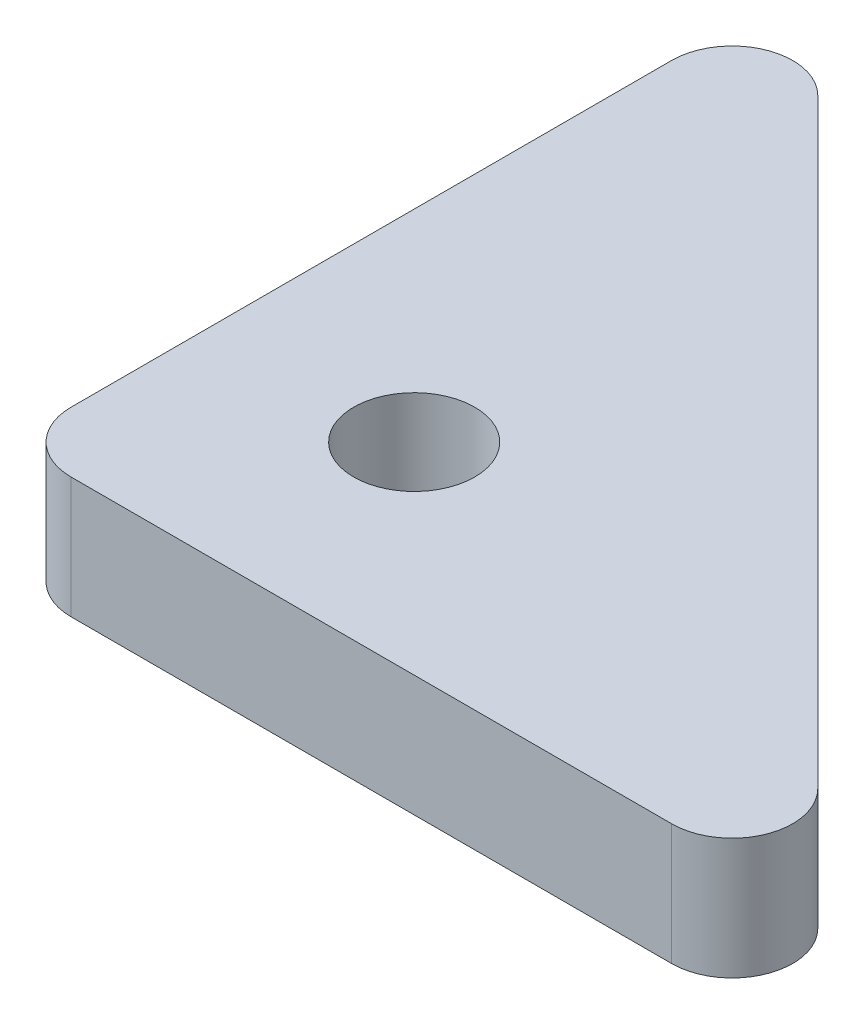
ISO-10303-21;
HEADER;
FILE_DESCRIPTION(('STEP AP214'),'2;1');
FILE_NAME('part.step','',(''),(''),'','','');
FILE_SCHEMA(('AUTOMOTIVE_DESIGN { 1 0 10303 214 1 1 1 1 }'));
ENDSEC;
DATA;
#1=APPLICATION_CONTEXT('core data for automotive mechanical design processes');
#2=APPLICATION_PROTOCOL_DEFINITION('international standard','automotive_design',2000,#1);
#3=PRODUCT_CONTEXT('',#1,'mechanical');
#4=PRODUCT('Part','Part','',(#3));
#5=PRODUCT_RELATED_PRODUCT_CATEGORY('part','',(#4));
#6=PRODUCT_DEFINITION_FORMATION('','',#4);
#7=PRODUCT_DEFINITION_CONTEXT('part definition',#1,'design');
#8=PRODUCT_DEFINITION('design','',#6,#7);
#9=PRODUCT_DEFINITION_SHAPE('','',#8);
#10=(LENGTH_UNIT() NAMED_UNIT(*) SI_UNIT(.MILLI.,.METRE.));
#11=(NAMED_UNIT(*) PLANE_ANGLE_UNIT() SI_UNIT($,.RADIAN.));
#12=(NAMED_UNIT(*) SI_UNIT($,.STERADIAN.) SOLID_ANGLE_UNIT());
#13=UNCERTAINTY_MEASURE_WITH_UNIT(LENGTH_MEASURE(1.E-05),#10,'distance_accuracy_value','');
#14=(GEOMETRIC_REPRESENTATION_CONTEXT(3) GLOBAL_UNCERTAINTY_ASSIGNED_CONTEXT((#13)) GLOBAL_UNIT_ASSIGNED_CONTEXT((#10,
#11,#12)) REPRESENTATION_CONTEXT('',''));
#15=CARTESIAN_POINT('',(0.,0.,0.));
#16=DIRECTION('',(0.,0.,1.));
#17=DIRECTION('',(1.,0.,0.));
#18=AXIS2_PLACEMENT_3D('',#15,#16,#17);
#19=CARTESIAN_POINT('',(2.99999999999995,0.,-3.00000000000011));
#20=DIRECTION('',(0.,-1.,0.));
#21=DIRECTION('',(1.,0.,0.));
#22=AXIS2_PLACEMENT_3D('',#19,#20,#21);
#23=PLANE('',#22);
#24=CARTESIAN_POINT('',(9.9999999999984,0.,-10.));
#25=DIRECTION('',(0.,-1.,0.));
#26=DIRECTION('',(1.,0.,0.));
#27=AXIS2_PLACEMENT_3D('',#24,#25,#26);
#28=CIRCLE('',#27,3.00000000000007);
#29=CARTESIAN_POINT('',(12.9999999999985,0.,-10.));
#30=VERTEX_POINT('',#29);
#31=EDGE_CURVE('E105',#30,#30,#28,.F.);
#32=ORIENTED_EDGE('',*,*,#31,.T.);
#33=EDGE_LOOP('',(#32));
#34=FACE_BOUND('',#33,.T.);
#35=CARTESIAN_POINT('',(32.7573593128807,0.,-3.00000000000011));
#36=DIRECTION('',(0.,-1.,0.));
#37=DIRECTION('',(1.,0.,0.));
#38=AXIS2_PLACEMENT_3D('',#35,#36,#37);
#39=CIRCLE('',#38,3.00000000000007);
#40=CARTESIAN_POINT('',(32.7573593128806,0.,0.));
#41=VERTEX_POINT('',#40);
#42=CARTESIAN_POINT('',(34.8786796564402,0.,-5.12132034355967));
#43=VERTEX_POINT('',#42);
#44=EDGE_CURVE('E95',#41,#43,#39,.F.);
#45=ORIENTED_EDGE('',*,*,#44,.F.);
#46=DIRECTION('',(-1.,0.,0.));
#47=VECTOR('',#46,1.);
#48=CARTESIAN_POINT('',(3.,0.,0.));
#49=LINE('',#48,#47);
#50=CARTESIAN_POINT('',(2.99999999999992,0.,0.));
#51=VERTEX_POINT('',#50);
#52=EDGE_CURVE('E91',#41,#51,#49,.T.);
#53=ORIENTED_EDGE('',*,*,#52,.T.);
#54=CARTESIAN_POINT('',(2.99999999999984,0.,-3.00000000000011));
#55=DIRECTION('',(0.,-1.,0.));
#56=DIRECTION('',(1.,0.,0.));
#57=AXIS2_PLACEMENT_3D('',#54,#55,#56);
#58=CIRCLE('',#57,3.00000000000007);
#59=CARTESIAN_POINT('',(-2.64285121565067E-12,0.,-3.00000000000011));
#60=VERTEX_POINT('',#59);
#61=EDGE_CURVE('E79',#60,#51,#58,.F.);
#62=ORIENTED_EDGE('',*,*,#61,.F.);
#63=DIRECTION('',(0.,0.,1.));
#64=VECTOR('',#63,1.);
#65=CARTESIAN_POINT('',(-5.05151476204446E-12,0.,-3.00000000000011));
#66=LINE('',#65,#64);
#67=CARTESIAN_POINT('',(-3.36536354339501E-12,0.,-32.7573593128807));
#68=VERTEX_POINT('',#67);
#69=EDGE_CURVE('E77',#60,#68,#66,.F.);
#70=ORIENTED_EDGE('',*,*,#69,.T.);
#71=CARTESIAN_POINT('',(2.99999999999839,0.,-32.7573593128807));
#72=DIRECTION('',(0.,-1.,0.));
#73=DIRECTION('',(1.,0.,0.));
#74=AXIS2_PLACEMENT_3D('',#71,#72,#73);
#75=CIRCLE('',#74,3.00000000000007);
#76=CARTESIAN_POINT('',(5.12132034355809,0.,-34.8786796564404));
#77=VERTEX_POINT('',#76);
#78=EDGE_CURVE('E19',#77,#68,#75,.F.);
#79=ORIENTED_EDGE('',*,*,#78,.F.);
#80=DIRECTION('',(0.707106781186559,0.,0.707106781186536));
#81=VECTOR('',#80,1.);
#82=CARTESIAN_POINT('',(5.12132034355811,0.,-34.8786796564404));
#83=LINE('',#82,#81);
#84=EDGE_CURVE('E94',#77,#43,#83,.T.);
#85=ORIENTED_EDGE('',*,*,#84,.T.);
#86=EDGE_LOOP('',(#45,#53,#62,#70,#79,#85));
#87=FACE_BOUND('',#86,.T.);
#88=ADVANCED_FACE('F16',(#34,#87),#23,.T.);
#89=CARTESIAN_POINT('',(-5.05151476204446E-12,6.00000000000001,-3.00000000000011));
#90=DIRECTION('',(1.,0.,0.));
#91=DIRECTION('',(0.,1.,0.));
#92=AXIS2_PLACEMENT_3D('',#89,#90,#91);
#93=PLANE('',#92);
#94=DIRECTION('',(0.,-1.,0.));
#95=VECTOR('',#94,1.);
#96=CARTESIAN_POINT('',(-2.34187669256869E-13,6.00000000000001,-3.00000000000011));
#97=LINE('',#96,#95);
#98=CARTESIAN_POINT('',(-2.64285121565067E-12,6.00000000000001,-3.00000000000011));
#99=VERTEX_POINT('',#98);
#100=EDGE_CURVE('E108',#99,#60,#97,.T.);
#101=ORIENTED_EDGE('',*,*,#100,.F.);
#102=DIRECTION('',(0.,0.,1.));
#103=VECTOR('',#102,1.);
#104=CARTESIAN_POINT('',(-5.05151476204446E-12,6.00000000000001,-3.00000000000011));
#105=LINE('',#104,#103);
#106=CARTESIAN_POINT('',(-3.36536354339501E-12,6.00000000000001,-32.7573593128807));
#107=VERTEX_POINT('',#106);
#108=EDGE_CURVE('E86',#99,#107,#105,.F.);
#109=ORIENTED_EDGE('',*,*,#108,.T.);
#110=DIRECTION('',(0.,-1.,0.));
#111=VECTOR('',#110,1.);
#112=CARTESIAN_POINT('',(-1.67921232474555E-12,6.00000000000001,-32.7573593128807));
#113=LINE('',#112,#111);
#114=EDGE_CURVE('E72',#68,#107,#113,.F.);
#115=ORIENTED_EDGE('',*,*,#114,.F.);
#116=ORIENTED_EDGE('',*,*,#69,.F.);
#117=EDGE_LOOP('',(#101,#109,#115,#116));
#118=FACE_BOUND('',#117,.T.);
#119=ADVANCED_FACE('F85',(#118),#93,.F.);
#120=CARTESIAN_POINT('',(2.99999999999839,6.00000000000001,-32.7573593128807));
#121=DIRECTION('',(0.,-1.,0.));
#122=DIRECTION('',(1.,0.,0.));
#123=AXIS2_PLACEMENT_3D('',#120,#121,#122);
#124=CYLINDRICAL_SURFACE('',#123,3.00000000000007);
#125=DIRECTION('',(0.,1.,0.));
#126=VECTOR('',#125,1.);
#127=CARTESIAN_POINT('',(5.12132034355811,6.00000000000001,-34.8786796564404));
#128=LINE('',#127,#126);
#129=CARTESIAN_POINT('',(5.12132034355809,6.00000000000001,-34.8786796564404));
#130=VERTEX_POINT('',#129);
#131=EDGE_CURVE('E75',#130,#77,#128,.F.);
#132=ORIENTED_EDGE('',*,*,#131,.T.);
#133=ORIENTED_EDGE('',*,*,#78,.T.);
#134=ORIENTED_EDGE('',*,*,#114,.T.);
#135=CARTESIAN_POINT('',(2.99999999999839,6.00000000000001,-32.7573593128807));
#136=DIRECTION('',(0.,-1.,0.));
#137=DIRECTION('',(1.,0.,0.));
#138=AXIS2_PLACEMENT_3D('',#135,#136,#137);
#139=CIRCLE('',#138,3.00000000000007);
#140=EDGE_CURVE('E103',#107,#130,#139,.T.);
#141=ORIENTED_EDGE('',*,*,#140,.T.);
#142=EDGE_LOOP('',(#132,#133,#134,#141));
#143=FACE_BOUND('',#142,.T.);
#144=ADVANCED_FACE('F70',(#143),#124,.T.);
#145=CARTESIAN_POINT('',(5.12132034355811,6.00000000000001,-34.8786796564404));
#146=DIRECTION('',(-0.707106781186536,0.,0.707106781186559));
#147=DIRECTION('',(0.707106781186559,0.,0.707106781186536));
#148=AXIS2_PLACEMENT_3D('',#145,#146,#147);
#149=PLANE('',#148);
#150=ORIENTED_EDGE('',*,*,#131,.F.);
#151=DIRECTION('',(0.707106781186562,0.,0.707106781186533));
#152=VECTOR('',#151,1.);
#153=CARTESIAN_POINT('',(5.12132034355811,6.00000000000001,-34.8786796564404));
#154=LINE('',#153,#152);
#155=CARTESIAN_POINT('',(34.8786796564402,6.00000000000001,-5.12132034355973));
#156=VERTEX_POINT('',#155);
#157=EDGE_CURVE('E102',#130,#156,#154,.T.);
#158=ORIENTED_EDGE('',*,*,#157,.T.);
#159=DIRECTION('',(0.,-1.,0.));
#160=VECTOR('',#159,1.);
#161=CARTESIAN_POINT('',(34.8786796564403,6.00000000000001,-5.12132034355981));
#162=LINE('',#161,#160);
#163=EDGE_CURVE('E109',#43,#156,#162,.F.);
#164=ORIENTED_EDGE('',*,*,#163,.F.);
#165=ORIENTED_EDGE('',*,*,#84,.F.);
#166=EDGE_LOOP('',(#150,#158,#164,#165));
#167=FACE_BOUND('',#166,.T.);
#168=ADVANCED_FACE('F131',(#167),#149,.F.);
#169=CARTESIAN_POINT('',(32.7573593128807,6.00000000000001,-3.00000000000011));
#170=DIRECTION('',(0.,-1.,0.));
#171=DIRECTION('',(1.,0.,0.));
#172=AXIS2_PLACEMENT_3D('',#169,#170,#171);
#173=CYLINDRICAL_SURFACE('',#172,3.00000000000007);
#174=CARTESIAN_POINT('',(32.7573593128807,6.00000000000001,-3.00000000000011));
#175=DIRECTION('',(0.,-1.,0.));
#176=DIRECTION('',(1.,0.,0.));
#177=AXIS2_PLACEMENT_3D('',#174,#175,#176);
#178=CIRCLE('',#177,3.00000000000007);
#179=CARTESIAN_POINT('',(32.7573593128806,6.00000000000001,0.));
#180=VERTEX_POINT('',#179);
#181=EDGE_CURVE('E99',#156,#180,#178,.T.);
#182=ORIENTED_EDGE('',*,*,#181,.T.);
#183=DIRECTION('',(0.,1.,0.));
#184=VECTOR('',#183,1.);
#185=CARTESIAN_POINT('',(32.7573593128806,6.00000000000001,0.));
#186=LINE('',#185,#184);
#187=EDGE_CURVE('E93',#180,#41,#186,.F.);
#188=ORIENTED_EDGE('',*,*,#187,.T.);
#189=ORIENTED_EDGE('',*,*,#44,.T.);
#190=ORIENTED_EDGE('',*,*,#163,.T.);
#191=EDGE_LOOP('',(#182,#188,#189,#190));
#192=FACE_BOUND('',#191,.T.);
#193=ADVANCED_FACE('F129',(#192),#173,.T.);
#194=CARTESIAN_POINT('',(3.,6.00000000000001,0.));
#195=DIRECTION('',(0.,0.,-1.));
#196=DIRECTION('',(-1.,0.,0.));
#197=AXIS2_PLACEMENT_3D('',#194,#195,#196);
#198=PLANE('',#197);
#199=ORIENTED_EDGE('',*,*,#187,.F.);
#200=DIRECTION('',(1.,0.,0.));
#201=VECTOR('',#200,1.);
#202=CARTESIAN_POINT('',(2.99999999999984,6.00000000000001,0.));
#203=LINE('',#202,#201);
#204=CARTESIAN_POINT('',(2.99999999999992,6.00000000000001,0.));
#205=VERTEX_POINT('',#204);
#206=EDGE_CURVE('E98',#180,#205,#203,.F.);
#207=ORIENTED_EDGE('',*,*,#206,.T.);
#208=DIRECTION('',(0.,-1.,0.));
#209=VECTOR('',#208,1.);
#210=CARTESIAN_POINT('',(3.,6.00000000000001,0.));
#211=LINE('',#210,#209);
#212=EDGE_CURVE('E34',#51,#205,#211,.F.);
#213=ORIENTED_EDGE('',*,*,#212,.F.);
#214=ORIENTED_EDGE('',*,*,#52,.F.);
#215=EDGE_LOOP('',(#199,#207,#213,#214));
#216=FACE_BOUND('',#215,.T.);
#217=ADVANCED_FACE('F124',(#216),#198,.F.);
#218=CARTESIAN_POINT('',(2.99999999999984,6.00000000000001,-3.00000000000011));
#219=DIRECTION('',(0.,-1.,0.));
#220=DIRECTION('',(1.,0.,0.));
#221=AXIS2_PLACEMENT_3D('',#218,#219,#220);
#222=CYLINDRICAL_SURFACE('',#221,3.00000000000007);
#223=CARTESIAN_POINT('',(2.99999999999984,6.00000000000001,-3.00000000000011));
#224=DIRECTION('',(0.,-1.,0.));
#225=DIRECTION('',(1.,0.,0.));
#226=AXIS2_PLACEMENT_3D('',#223,#224,#225);
#227=CIRCLE('',#226,3.00000000000007);
#228=EDGE_CURVE('E25',#205,#99,#227,.T.);
#229=ORIENTED_EDGE('',*,*,#228,.T.);
#230=ORIENTED_EDGE('',*,*,#100,.T.);
#231=ORIENTED_EDGE('',*,*,#61,.T.);
#232=ORIENTED_EDGE('',*,*,#212,.T.);
#233=EDGE_LOOP('',(#229,#230,#231,#232));
#234=FACE_BOUND('',#233,.T.);
#235=ADVANCED_FACE('F138',(#234),#222,.T.);
#236=CARTESIAN_POINT('',(9.9999999999984,6.00000000000001,-10.));
#237=DIRECTION('',(0.,-1.,0.));
#238=DIRECTION('',(1.,0.,0.));
#239=AXIS2_PLACEMENT_3D('',#236,#237,#238);
#240=CYLINDRICAL_SURFACE('',#239,3.00000000000007);
#241=ORIENTED_EDGE('',*,*,#31,.F.);
#242=EDGE_LOOP('',(#241));
#243=FACE_BOUND('',#242,.T.);
#244=CARTESIAN_POINT('',(9.9999999999984,6.00000000000001,-10.));
#245=DIRECTION('',(0.,-1.,0.));
#246=DIRECTION('',(1.,0.,0.));
#247=AXIS2_PLACEMENT_3D('',#244,#245,#246);
#248=CIRCLE('',#247,3.00000000000007);
#249=CARTESIAN_POINT('',(12.9999999999985,6.00000000000001,-10.));
#250=VERTEX_POINT('',#249);
#251=EDGE_CURVE('E11',#250,#250,#248,.F.);
#252=ORIENTED_EDGE('',*,*,#251,.T.);
#253=EDGE_LOOP('',(#252));
#254=FACE_BOUND('',#253,.T.);
#255=ADVANCED_FACE('F143',(#243,#254),#240,.F.);
#256=CARTESIAN_POINT('',(2.99999999999984,6.00000000000001,-3.00000000000011));
#257=DIRECTION('',(0.,-1.,0.));
#258=DIRECTION('',(1.,0.,0.));
#259=AXIS2_PLACEMENT_3D('',#256,#257,#258);
#260=PLANE('',#259);
#261=ORIENTED_EDGE('',*,*,#251,.F.);
#262=EDGE_LOOP('',(#261));
#263=FACE_BOUND('',#262,.T.);
#264=ORIENTED_EDGE('',*,*,#206,.F.);
#265=ORIENTED_EDGE('',*,*,#181,.F.);
#266=ORIENTED_EDGE('',*,*,#157,.F.);
#267=ORIENTED_EDGE('',*,*,#140,.F.);
#268=ORIENTED_EDGE('',*,*,#108,.F.);
#269=ORIENTED_EDGE('',*,*,#228,.F.);
#270=EDGE_LOOP('',(#264,#265,#266,#267,#268,#269));
#271=FACE_BOUND('',#270,.T.);
#272=ADVANCED_FACE('F127',(#263,#271),#260,.F.);
#273=CLOSED_SHELL('',(#88,#119,#144,#168,#193,#217,#235,#255,#272));
#274=MANIFOLD_SOLID_BREP('B1',#273);
#275=ADVANCED_BREP_SHAPE_REPRESENTATION('',(#18,#274),#14);
#276=SHAPE_DEFINITION_REPRESENTATION(#9,#275);
ENDSEC;
END-ISO-10303-21;
